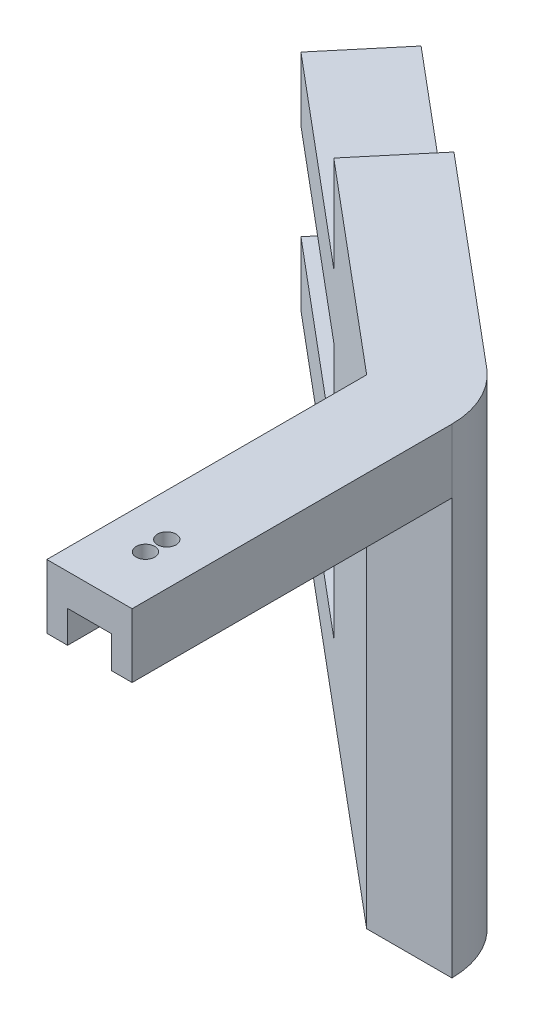
ISO-10303-21;
HEADER;
FILE_DESCRIPTION(('STEP AP214'),'2;1');
FILE_NAME('part.step','',(''),(''),'','','');
FILE_SCHEMA(('AUTOMOTIVE_DESIGN { 1 0 10303 214 1 1 1 1 }'));
ENDSEC;
DATA;
#1=APPLICATION_CONTEXT('core data for automotive mechanical design processes');
#2=APPLICATION_PROTOCOL_DEFINITION('international standard','automotive_design',2000,#1);
#3=PRODUCT_CONTEXT('',#1,'mechanical');
#4=PRODUCT('Part','Part','',(#3));
#5=PRODUCT_RELATED_PRODUCT_CATEGORY('part','',(#4));
#6=PRODUCT_DEFINITION_FORMATION('','',#4);
#7=PRODUCT_DEFINITION_CONTEXT('part definition',#1,'design');
#8=PRODUCT_DEFINITION('design','',#6,#7);
#9=PRODUCT_DEFINITION_SHAPE('','',#8);
#10=(LENGTH_UNIT() NAMED_UNIT(*) SI_UNIT(.MILLI.,.METRE.));
#11=(NAMED_UNIT(*) PLANE_ANGLE_UNIT() SI_UNIT($,.RADIAN.));
#12=(NAMED_UNIT(*) SI_UNIT($,.STERADIAN.) SOLID_ANGLE_UNIT());
#13=UNCERTAINTY_MEASURE_WITH_UNIT(LENGTH_MEASURE(1.E-05),#10,'distance_accuracy_value','');
#14=(GEOMETRIC_REPRESENTATION_CONTEXT(3) GLOBAL_UNCERTAINTY_ASSIGNED_CONTEXT((#13)) GLOBAL_UNIT_ASSIGNED_CONTEXT((#10,
#11,#12)) REPRESENTATION_CONTEXT('',''));
#15=CARTESIAN_POINT('',(0.,0.,0.));
#16=DIRECTION('',(0.,0.,1.));
#17=DIRECTION('',(1.,0.,0.));
#18=AXIS2_PLACEMENT_3D('',#15,#16,#17);
#19=CARTESIAN_POINT('',(0.,0.,0.));
#20=DIRECTION('',(0.,1.,0.));
#21=DIRECTION('',(0.,0.,1.));
#22=AXIS2_PLACEMENT_3D('',#19,#20,#21);
#23=PLANE('',#22);
#24=CARTESIAN_POINT('',(0.,0.,15.5));
#25=DIRECTION('',(0.,1.,0.));
#26=DIRECTION('',(0.,0.,1.));
#27=AXIS2_PLACEMENT_3D('',#24,#25,#26);
#28=CIRCLE('',#27,1.75);
#29=CARTESIAN_POINT('',(0.,0.,17.25));
#30=VERTEX_POINT('',#29);
#31=EDGE_CURVE('E443',#30,#30,#28,.T.);
#32=ORIENTED_EDGE('',*,*,#31,.F.);
#33=EDGE_LOOP('',(#32));
#34=FACE_BOUND('',#33,.T.);
#35=CARTESIAN_POINT('',(0.,0.,19.5));
#36=DIRECTION('',(0.,1.,0.));
#37=DIRECTION('',(0.,0.,1.));
#38=AXIS2_PLACEMENT_3D('',#35,#36,#37);
#39=CIRCLE('',#38,1.75);
#40=CARTESIAN_POINT('',(0.,0.,21.25));
#41=VERTEX_POINT('',#40);
#42=EDGE_CURVE('E444',#41,#41,#39,.T.);
#43=ORIENTED_EDGE('',*,*,#42,.F.);
#44=EDGE_LOOP('',(#43));
#45=FACE_BOUND('',#44,.T.);
#46=DIRECTION('',(-0.76604444311897,0.,-0.642787609686549));
#47=VECTOR('',#46,1.);
#48=CARTESIAN_POINT('',(21.7513107608356,0.,-25.9222027428582));
#49=LINE('',#48,#47);
#50=CARTESIAN_POINT('',(2.28460175498478,0.,-42.2567110899035));
#51=VERTEX_POINT('',#50);
#52=CARTESIAN_POINT('',(-36.0176204009637,0.,-74.3960915742309));
#53=VERTEX_POINT('',#52);
#54=EDGE_CURVE('E297',#51,#53,#49,.T.);
#55=ORIENTED_EDGE('',*,*,#54,.T.);
#56=DIRECTION('',(-0.64278760968655,0.,0.76604444311897));
#57=VECTOR('',#56,1.);
#58=CARTESIAN_POINT('',(-36.0176204009637,0.,-74.3960915742309));
#59=LINE('',#58,#57);
#60=CARTESIAN_POINT('',(-46.3022221559485,0.,-62.1393804843274));
#61=VERTEX_POINT('',#60);
#62=EDGE_CURVE('E263',#53,#61,#59,.T.);
#63=ORIENTED_EDGE('',*,*,#62,.T.);
#64=DIRECTION('',(-0.76604444311897,0.,-0.642787609686549));
#65=VECTOR('',#64,1.);
#66=CARTESIAN_POINT('',(11.4667090058508,0.,-13.6654916529547));
#67=LINE('',#66,#65);
#68=CARTESIAN_POINT('',(-8.,0.,-30.));
#69=VERTEX_POINT('',#68);
#70=EDGE_CURVE('E255',#69,#61,#67,.T.);
#71=ORIENTED_EDGE('',*,*,#70,.F.);
#72=DIRECTION('',(0.,0.,1.));
#73=VECTOR('',#72,1.);
#74=CARTESIAN_POINT('',(-8.,0.,0.));
#75=LINE('',#74,#73);
#76=CARTESIAN_POINT('',(-8.,0.,30.));
#77=VERTEX_POINT('',#76);
#78=EDGE_CURVE('E235',#69,#77,#75,.T.);
#79=ORIENTED_EDGE('',*,*,#78,.T.);
#80=DIRECTION('',(1.,0.,0.));
#81=VECTOR('',#80,1.);
#82=CARTESIAN_POINT('',(0.,0.,30.));
#83=LINE('',#82,#81);
#84=CARTESIAN_POINT('',(8.,0.,30.));
#85=VERTEX_POINT('',#84);
#86=EDGE_CURVE('E240',#77,#85,#83,.T.);
#87=ORIENTED_EDGE('',*,*,#86,.T.);
#88=DIRECTION('',(0.,0.,1.));
#89=VECTOR('',#88,1.);
#90=CARTESIAN_POINT('',(8.,0.,0.));
#91=LINE('',#90,#89);
#92=CARTESIAN_POINT('',(8.,0.,-30.));
#93=VERTEX_POINT('',#92);
#94=EDGE_CURVE('E231',#93,#85,#91,.T.);
#95=ORIENTED_EDGE('',*,*,#94,.F.);
#96=CARTESIAN_POINT('',(-8.,0.,-30.));
#97=DIRECTION('',(0.,1.,0.));
#98=DIRECTION('',(0.,0.,1.));
#99=AXIS2_PLACEMENT_3D('',#96,#97,#98);
#100=CIRCLE('',#99,16.);
#101=EDGE_CURVE('E265',#93,#51,#100,.T.);
#102=ORIENTED_EDGE('',*,*,#101,.T.);
#103=EDGE_LOOP('',(#55,#63,#71,#79,#87,#95,#102));
#104=FACE_BOUND('',#103,.T.);
#105=ADVANCED_FACE('F41',(#34,#45,#104),#23,.T.);
#106=CARTESIAN_POINT('',(-96.0711533177478,-90.,-80.6132693157002));
#107=DIRECTION('',(0.76604444311897,0.,0.642787609686549));
#108=DIRECTION('',(0.642787609686549,0.,-0.76604444311897));
#109=AXIS2_PLACEMENT_3D('',#106,#107,#108);
#110=PLANE('',#109);
#111=DIRECTION('',(-0.64278760968655,0.,0.76604444311897));
#112=VECTOR('',#111,1.);
#113=CARTESIAN_POINT('',(-74.3198425569122,-60.,-106.535472058558));
#114=LINE('',#113,#112);
#115=CARTESIAN_POINT('',(-74.3198425569122,-60.,-106.535472058558));
#116=VERTEX_POINT('',#115);
#117=CARTESIAN_POINT('',(-84.604444311897,-60.,-94.2787609686549));
#118=VERTEX_POINT('',#117);
#119=EDGE_CURVE('E366',#116,#118,#114,.T.);
#120=ORIENTED_EDGE('',*,*,#119,.T.);
#121=DIRECTION('',(0.,1.,0.));
#122=VECTOR('',#121,1.);
#123=CARTESIAN_POINT('',(-84.604444311897,-90.,-94.2787609686549));
#124=LINE('',#123,#122);
#125=CARTESIAN_POINT('',(-84.604444311897,-48.,-94.2787609686549));
#126=VERTEX_POINT('',#125);
#127=EDGE_CURVE('E282',#118,#126,#124,.T.);
#128=ORIENTED_EDGE('',*,*,#127,.T.);
#129=DIRECTION('',(-0.64278760968655,0.,0.76604444311897));
#130=VECTOR('',#129,1.);
#131=CARTESIAN_POINT('',(-74.3198425569122,-48.,-106.535472058558));
#132=LINE('',#131,#130);
#133=CARTESIAN_POINT('',(-74.3198425569122,-48.,-106.535472058558));
#134=VERTEX_POINT('',#133);
#135=EDGE_CURVE('E349',#134,#126,#132,.T.);
#136=ORIENTED_EDGE('',*,*,#135,.F.);
#137=DIRECTION('',(0.,1.,0.));
#138=VECTOR('',#137,1.);
#139=CARTESIAN_POINT('',(-74.3198425569122,-90.,-106.535472058558));
#140=LINE('',#139,#138);
#141=EDGE_CURVE('E296',#116,#134,#140,.T.);
#142=ORIENTED_EDGE('',*,*,#141,.F.);
#143=EDGE_LOOP('',(#120,#128,#136,#142));
#144=FACE_BOUND('',#143,.T.);
#145=ADVANCED_FACE('F457',(#144),#110,.F.);
#146=DIRECTION('',(-0.64278760968655,0.,0.76604444311897));
#147=VECTOR('',#146,1.);
#148=CARTESIAN_POINT('',(-74.3198425569122,-30.,-106.535472058558));
#149=LINE('',#148,#147);
#150=CARTESIAN_POINT('',(-74.3198425569122,-30.,-106.535472058558));
#151=VERTEX_POINT('',#150);
#152=CARTESIAN_POINT('',(-84.604444311897,-30.,-94.2787609686549));
#153=VERTEX_POINT('',#152);
#154=EDGE_CURVE('E362',#151,#153,#149,.T.);
#155=ORIENTED_EDGE('',*,*,#154,.T.);
#156=CARTESIAN_POINT('',(-84.604444311897,-18.,-94.2787609686549));
#157=VERTEX_POINT('',#156);
#158=EDGE_CURVE('E283',#153,#157,#124,.T.);
#159=ORIENTED_EDGE('',*,*,#158,.T.);
#160=DIRECTION('',(-0.64278760968655,0.,0.76604444311897));
#161=VECTOR('',#160,1.);
#162=CARTESIAN_POINT('',(-74.3198425569122,-18.,-106.535472058558));
#163=LINE('',#162,#161);
#164=CARTESIAN_POINT('',(-74.3198425569122,-18.,-106.535472058558));
#165=VERTEX_POINT('',#164);
#166=EDGE_CURVE('E324',#165,#157,#163,.T.);
#167=ORIENTED_EDGE('',*,*,#166,.F.);
#168=EDGE_CURVE('E292',#151,#165,#140,.T.);
#169=ORIENTED_EDGE('',*,*,#168,.F.);
#170=EDGE_LOOP('',(#155,#159,#167,#169));
#171=FACE_BOUND('',#170,.T.);
#172=ADVANCED_FACE('F497',(#171),#110,.F.);
#173=CARTESIAN_POINT('',(21.7513107608356,-90.,-25.9222027428582));
#174=DIRECTION('',(0.642787609686549,0.,-0.76604444311897));
#175=DIRECTION('',(-0.76604444311897,0.,-0.642787609686549));
#176=AXIS2_PLACEMENT_3D('',#173,#174,#175);
#177=PLANE('',#176);
#178=DIRECTION('',(0.,-1.,0.));
#179=VECTOR('',#178,1.);
#180=CARTESIAN_POINT('',(-36.0176204009637,-60.,-74.3960915742309));
#181=LINE('',#180,#179);
#182=CARTESIAN_POINT('',(-36.0176204009637,-60.,-74.3960915742309));
#183=VERTEX_POINT('',#182);
#184=CARTESIAN_POINT('',(-36.0176204009637,-78.,-74.3960915742309));
#185=VERTEX_POINT('',#184);
#186=EDGE_CURVE('E394',#183,#185,#181,.T.);
#187=ORIENTED_EDGE('',*,*,#186,.F.);
#188=DIRECTION('',(-0.76604444311897,0.,-0.642787609686549));
#189=VECTOR('',#188,1.);
#190=CARTESIAN_POINT('',(-36.0176204009637,-60.,-74.3960915742309));
#191=LINE('',#190,#189);
#192=EDGE_CURVE('E390',#183,#116,#191,.T.);
#193=ORIENTED_EDGE('',*,*,#192,.T.);
#194=ORIENTED_EDGE('',*,*,#141,.T.);
#195=DIRECTION('',(-0.76604444311897,0.,-0.642787609686549));
#196=VECTOR('',#195,1.);
#197=CARTESIAN_POINT('',(-36.0176204009637,-48.,-74.3960915742309));
#198=LINE('',#197,#196);
#199=CARTESIAN_POINT('',(-36.0176204009637,-48.,-74.3960915742309));
#200=VERTEX_POINT('',#199);
#201=EDGE_CURVE('E372',#200,#134,#198,.T.);
#202=ORIENTED_EDGE('',*,*,#201,.F.);
#203=DIRECTION('',(0.,-1.,0.));
#204=VECTOR('',#203,1.);
#205=CARTESIAN_POINT('',(-36.0176204009637,-30.,-74.3960915742309));
#206=LINE('',#205,#204);
#207=CARTESIAN_POINT('',(-36.0176204009637,-30.,-74.3960915742309));
#208=VERTEX_POINT('',#207);
#209=EDGE_CURVE('E357',#208,#200,#206,.T.);
#210=ORIENTED_EDGE('',*,*,#209,.F.);
#211=DIRECTION('',(-0.76604444311897,0.,-0.642787609686549));
#212=VECTOR('',#211,1.);
#213=CARTESIAN_POINT('',(-36.0176204009637,-30.,-74.3960915742309));
#214=LINE('',#213,#212);
#215=EDGE_CURVE('E361',#208,#151,#214,.T.);
#216=ORIENTED_EDGE('',*,*,#215,.T.);
#217=ORIENTED_EDGE('',*,*,#168,.T.);
#218=DIRECTION('',(-0.76604444311897,0.,-0.642787609686549));
#219=VECTOR('',#218,1.);
#220=CARTESIAN_POINT('',(-36.0176204009637,-18.,-74.3960915742309));
#221=LINE('',#220,#219);
#222=CARTESIAN_POINT('',(-36.0176204009637,-18.,-74.3960915742309));
#223=VERTEX_POINT('',#222);
#224=EDGE_CURVE('E334',#223,#165,#221,.T.);
#225=ORIENTED_EDGE('',*,*,#224,.F.);
#226=DIRECTION('',(0.,-1.,0.));
#227=VECTOR('',#226,1.);
#228=CARTESIAN_POINT('',(-36.0176204009637,0.,-74.3960915742309));
#229=LINE('',#228,#227);
#230=EDGE_CURVE('E328',#53,#223,#229,.T.);
#231=ORIENTED_EDGE('',*,*,#230,.F.);
#232=ORIENTED_EDGE('',*,*,#54,.F.);
#233=DIRECTION('',(0.,1.,0.));
#234=VECTOR('',#233,1.);
#235=CARTESIAN_POINT('',(2.28460175498478,-90.,-42.2567110899035));
#236=LINE('',#235,#234);
#237=CARTESIAN_POINT('',(2.28460175498478,-90.,-42.2567110899035));
#238=VERTEX_POINT('',#237);
#239=EDGE_CURVE('E289',#238,#51,#236,.T.);
#240=ORIENTED_EDGE('',*,*,#239,.F.);
#241=DIRECTION('',(-0.76604444311897,0.,-0.642787609686549));
#242=VECTOR('',#241,1.);
#243=CARTESIAN_POINT('',(21.7513107608356,-90.,-25.9222027428582));
#244=LINE('',#243,#242);
#245=CARTESIAN_POINT('',(-74.3198425569122,-90.,-106.535472058558));
#246=VERTEX_POINT('',#245);
#247=EDGE_CURVE('E304',#238,#246,#244,.T.);
#248=ORIENTED_EDGE('',*,*,#247,.T.);
#249=CARTESIAN_POINT('',(-74.3198425569122,-78.,-106.535472058558));
#250=VERTEX_POINT('',#249);
#251=EDGE_CURVE('E236',#246,#250,#140,.T.);
#252=ORIENTED_EDGE('',*,*,#251,.T.);
#253=DIRECTION('',(-0.76604444311897,0.,-0.642787609686549));
#254=VECTOR('',#253,1.);
#255=CARTESIAN_POINT('',(-36.0176204009637,-78.,-74.3960915742309));
#256=LINE('',#255,#254);
#257=EDGE_CURVE('E387',#185,#250,#256,.T.);
#258=ORIENTED_EDGE('',*,*,#257,.F.);
#259=EDGE_LOOP('',(#187,#193,#194,#202,#210,#216,#217,#225,#231,#232,#240,#248,#252,#258));
#260=FACE_BOUND('',#259,.T.);
#261=ADVANCED_FACE('F485',(#260),#177,.T.);
#262=CARTESIAN_POINT('',(11.4667090058508,-90.,-13.6654916529547));
#263=DIRECTION('',(0.642787609686549,0.,-0.76604444311897));
#264=DIRECTION('',(-0.76604444311897,0.,-0.642787609686549));
#265=AXIS2_PLACEMENT_3D('',#262,#263,#264);
#266=PLANE('',#265);
#267=DIRECTION('',(-0.76604444311897,0.,-0.642787609686549));
#268=VECTOR('',#267,1.);
#269=CARTESIAN_POINT('',(-46.3022221559485,-60.,-62.1393804843274));
#270=LINE('',#269,#268);
#271=CARTESIAN_POINT('',(-46.3022221559485,-60.,-62.1393804843274));
#272=VERTEX_POINT('',#271);
#273=EDGE_CURVE('E266',#272,#118,#270,.T.);
#274=ORIENTED_EDGE('',*,*,#273,.F.);
#275=DIRECTION('',(0.,-1.,0.));
#276=VECTOR('',#275,1.);
#277=CARTESIAN_POINT('',(-46.3022221559485,-60.,-62.1393804843274));
#278=LINE('',#277,#276);
#279=CARTESIAN_POINT('',(-46.3022221559485,-78.,-62.1393804843274));
#280=VERTEX_POINT('',#279);
#281=EDGE_CURVE('E406',#272,#280,#278,.T.);
#282=ORIENTED_EDGE('',*,*,#281,.T.);
#283=DIRECTION('',(-0.76604444311897,0.,-0.642787609686549));
#284=VECTOR('',#283,1.);
#285=CARTESIAN_POINT('',(-46.3022221559485,-78.,-62.1393804843274));
#286=LINE('',#285,#284);
#287=CARTESIAN_POINT('',(-84.604444311897,-78.,-94.2787609686549));
#288=VERTEX_POINT('',#287);
#289=EDGE_CURVE('E383',#280,#288,#286,.T.);
#290=ORIENTED_EDGE('',*,*,#289,.T.);
#291=CARTESIAN_POINT('',(-84.604444311897,-90.,-94.2787609686549));
#292=VERTEX_POINT('',#291);
#293=EDGE_CURVE('E278',#292,#288,#124,.T.);
#294=ORIENTED_EDGE('',*,*,#293,.F.);
#295=DIRECTION('',(-0.76604444311897,0.,-0.642787609686549));
#296=VECTOR('',#295,1.);
#297=CARTESIAN_POINT('',(11.4667090058508,-90.,-13.6654916529547));
#298=LINE('',#297,#296);
#299=CARTESIAN_POINT('',(-8.,-90.,-30.));
#300=VERTEX_POINT('',#299);
#301=EDGE_CURVE('E316',#300,#292,#298,.T.);
#302=ORIENTED_EDGE('',*,*,#301,.F.);
#303=DIRECTION('',(0.,1.,0.));
#304=VECTOR('',#303,1.);
#305=CARTESIAN_POINT('',(-8.,-90.,-30.));
#306=LINE('',#305,#304);
#307=CARTESIAN_POINT('',(-8.,-12.,-30.));
#308=VERTEX_POINT('',#307);
#309=EDGE_CURVE('E257',#300,#308,#306,.T.);
#310=ORIENTED_EDGE('',*,*,#309,.T.);
#311=DIRECTION('',(0.,1.,0.));
#312=VECTOR('',#311,1.);
#313=CARTESIAN_POINT('',(-8.,-12.,-30.));
#314=LINE('',#313,#312);
#315=EDGE_CURVE('E226',#308,#69,#314,.T.);
#316=ORIENTED_EDGE('',*,*,#315,.T.);
#317=ORIENTED_EDGE('',*,*,#70,.T.);
#318=DIRECTION('',(0.,-1.,0.));
#319=VECTOR('',#318,1.);
#320=CARTESIAN_POINT('',(-46.3022221559485,0.,-62.1393804843274));
#321=LINE('',#320,#319);
#322=CARTESIAN_POINT('',(-46.3022221559485,-18.,-62.1393804843274));
#323=VERTEX_POINT('',#322);
#324=EDGE_CURVE('E321',#61,#323,#321,.T.);
#325=ORIENTED_EDGE('',*,*,#324,.T.);
#326=DIRECTION('',(-0.76604444311897,0.,-0.642787609686549));
#327=VECTOR('',#326,1.);
#328=CARTESIAN_POINT('',(-46.3022221559485,-18.,-62.1393804843274));
#329=LINE('',#328,#327);
#330=EDGE_CURVE('E340',#323,#157,#329,.T.);
#331=ORIENTED_EDGE('',*,*,#330,.T.);
#332=ORIENTED_EDGE('',*,*,#158,.F.);
#333=DIRECTION('',(-0.76604444311897,0.,-0.642787609686549));
#334=VECTOR('',#333,1.);
#335=CARTESIAN_POINT('',(-46.3022221559485,-30.,-62.1393804843274));
#336=LINE('',#335,#334);
#337=CARTESIAN_POINT('',(-46.3022221559485,-30.,-62.1393804843274));
#338=VERTEX_POINT('',#337);
#339=EDGE_CURVE('E337',#338,#153,#336,.T.);
#340=ORIENTED_EDGE('',*,*,#339,.F.);
#341=DIRECTION('',(0.,-1.,0.));
#342=VECTOR('',#341,1.);
#343=CARTESIAN_POINT('',(-46.3022221559485,-30.,-62.1393804843274));
#344=LINE('',#343,#342);
#345=CARTESIAN_POINT('',(-46.3022221559485,-48.,-62.1393804843274));
#346=VERTEX_POINT('',#345);
#347=EDGE_CURVE('E350',#338,#346,#344,.T.);
#348=ORIENTED_EDGE('',*,*,#347,.T.);
#349=DIRECTION('',(-0.76604444311897,0.,-0.642787609686549));
#350=VECTOR('',#349,1.);
#351=CARTESIAN_POINT('',(-46.3022221559485,-48.,-62.1393804843274));
#352=LINE('',#351,#350);
#353=EDGE_CURVE('E375',#346,#126,#352,.T.);
#354=ORIENTED_EDGE('',*,*,#353,.T.);
#355=ORIENTED_EDGE('',*,*,#127,.F.);
#356=EDGE_LOOP('',(#274,#282,#290,#294,#302,#310,#316,#317,#325,#331,#332,#340,#348,#354,#355));
#357=FACE_BOUND('',#356,.T.);
#358=ADVANCED_FACE('F253',(#357),#266,.F.);
#359=CARTESIAN_POINT('',(8.,-12.,0.));
#360=DIRECTION('',(-1.,0.,0.));
#361=DIRECTION('',(0.,0.,1.));
#362=AXIS2_PLACEMENT_3D('',#359,#360,#361);
#363=PLANE('',#362);
#364=ORIENTED_EDGE('',*,*,#94,.T.);
#365=DIRECTION('',(0.,1.,0.));
#366=VECTOR('',#365,1.);
#367=CARTESIAN_POINT('',(8.,-12.,30.));
#368=LINE('',#367,#366);
#369=CARTESIAN_POINT('',(8.,-12.,30.));
#370=VERTEX_POINT('',#369);
#371=EDGE_CURVE('E11',#370,#85,#368,.T.);
#372=ORIENTED_EDGE('',*,*,#371,.F.);
#373=DIRECTION('',(0.,0.,1.));
#374=VECTOR('',#373,1.);
#375=CARTESIAN_POINT('',(8.,-12.,0.));
#376=LINE('',#375,#374);
#377=CARTESIAN_POINT('',(8.,-12.,-30.));
#378=VERTEX_POINT('',#377);
#379=EDGE_CURVE('E243',#378,#370,#376,.T.);
#380=ORIENTED_EDGE('',*,*,#379,.F.);
#381=DIRECTION('',(0.,1.,0.));
#382=VECTOR('',#381,1.);
#383=CARTESIAN_POINT('',(8.,-12.,-30.));
#384=LINE('',#383,#382);
#385=EDGE_CURVE('E45',#378,#93,#384,.T.);
#386=ORIENTED_EDGE('',*,*,#385,.T.);
#387=EDGE_LOOP('',(#364,#372,#380,#386));
#388=FACE_BOUND('',#387,.T.);
#389=ADVANCED_FACE('F43',(#388),#363,.F.);
#390=CARTESIAN_POINT('',(0.,-12.,30.));
#391=DIRECTION('',(0.,0.,1.));
#392=DIRECTION('',(1.,0.,0.));
#393=AXIS2_PLACEMENT_3D('',#390,#391,#392);
#394=PLANE('',#393);
#395=DIRECTION('',(0.,1.,0.));
#396=VECTOR('',#395,1.);
#397=CARTESIAN_POINT('',(-4.1,-12.,30.));
#398=LINE('',#397,#396);
#399=CARTESIAN_POINT('',(-4.1,-12.,30.));
#400=VERTEX_POINT('',#399);
#401=CARTESIAN_POINT('',(-4.1,-6.,30.));
#402=VERTEX_POINT('',#401);
#403=EDGE_CURVE('E193',#400,#402,#398,.T.);
#404=ORIENTED_EDGE('',*,*,#403,.T.);
#405=DIRECTION('',(1.,0.,0.));
#406=VECTOR('',#405,1.);
#407=CARTESIAN_POINT('',(0.,-6.,30.));
#408=LINE('',#407,#406);
#409=CARTESIAN_POINT('',(4.1,-6.,30.));
#410=VERTEX_POINT('',#409);
#411=EDGE_CURVE('E426',#402,#410,#408,.T.);
#412=ORIENTED_EDGE('',*,*,#411,.T.);
#413=DIRECTION('',(0.,1.,0.));
#414=VECTOR('',#413,1.);
#415=CARTESIAN_POINT('',(4.1,-12.,30.));
#416=LINE('',#415,#414);
#417=CARTESIAN_POINT('',(4.1,-12.,30.));
#418=VERTEX_POINT('',#417);
#419=EDGE_CURVE('E204',#418,#410,#416,.T.);
#420=ORIENTED_EDGE('',*,*,#419,.F.);
#421=DIRECTION('',(1.,0.,0.));
#422=VECTOR('',#421,1.);
#423=CARTESIAN_POINT('',(0.,-12.,30.));
#424=LINE('',#423,#422);
#425=EDGE_CURVE('E221',#418,#370,#424,.T.);
#426=ORIENTED_EDGE('',*,*,#425,.T.);
#427=ORIENTED_EDGE('',*,*,#371,.T.);
#428=ORIENTED_EDGE('',*,*,#86,.F.);
#429=DIRECTION('',(0.,1.,0.));
#430=VECTOR('',#429,1.);
#431=CARTESIAN_POINT('',(-8.,-12.,30.));
#432=LINE('',#431,#430);
#433=CARTESIAN_POINT('',(-8.,-12.,30.));
#434=VERTEX_POINT('',#433);
#435=EDGE_CURVE('E51',#434,#77,#432,.T.);
#436=ORIENTED_EDGE('',*,*,#435,.F.);
#437=EDGE_CURVE('E211',#434,#400,#424,.T.);
#438=ORIENTED_EDGE('',*,*,#437,.T.);
#439=EDGE_LOOP('',(#404,#412,#420,#426,#427,#428,#436,#438));
#440=FACE_BOUND('',#439,.T.);
#441=ADVANCED_FACE('F217',(#440),#394,.T.);
#442=CARTESIAN_POINT('',(-8.,-12.,0.));
#443=DIRECTION('',(-1.,0.,0.));
#444=DIRECTION('',(0.,0.,1.));
#445=AXIS2_PLACEMENT_3D('',#442,#443,#444);
#446=PLANE('',#445);
#447=ORIENTED_EDGE('',*,*,#78,.F.);
#448=ORIENTED_EDGE('',*,*,#315,.F.);
#449=DIRECTION('',(0.,0.,1.));
#450=VECTOR('',#449,1.);
#451=CARTESIAN_POINT('',(-8.,-12.,0.));
#452=LINE('',#451,#450);
#453=EDGE_CURVE('E227',#308,#434,#452,.T.);
#454=ORIENTED_EDGE('',*,*,#453,.T.);
#455=ORIENTED_EDGE('',*,*,#435,.T.);
#456=EDGE_LOOP('',(#447,#448,#454,#455));
#457=FACE_BOUND('',#456,.T.);
#458=ADVANCED_FACE('F268',(#457),#446,.T.);
#459=CARTESIAN_POINT('',(0.,-12.,0.));
#460=DIRECTION('',(0.,1.,0.));
#461=DIRECTION('',(0.,0.,1.));
#462=AXIS2_PLACEMENT_3D('',#459,#460,#461);
#463=PLANE('',#462);
#464=DIRECTION('',(1.,0.,0.));
#465=VECTOR('',#464,1.);
#466=CARTESIAN_POINT('',(0.,-12.,10.));
#467=LINE('',#466,#465);
#468=CARTESIAN_POINT('',(-4.1,-12.,10.));
#469=VERTEX_POINT('',#468);
#470=CARTESIAN_POINT('',(4.1,-12.,10.));
#471=VERTEX_POINT('',#470);
#472=EDGE_CURVE('E205',#469,#471,#467,.T.);
#473=ORIENTED_EDGE('',*,*,#472,.F.);
#474=DIRECTION('',(0.,0.,1.));
#475=VECTOR('',#474,1.);
#476=CARTESIAN_POINT('',(-4.1,-12.,0.));
#477=LINE('',#476,#475);
#478=EDGE_CURVE('E196',#469,#400,#477,.T.);
#479=ORIENTED_EDGE('',*,*,#478,.T.);
#480=ORIENTED_EDGE('',*,*,#437,.F.);
#481=ORIENTED_EDGE('',*,*,#453,.F.);
#482=DIRECTION('',(1.,0.,0.));
#483=VECTOR('',#482,1.);
#484=CARTESIAN_POINT('',(0.,-12.,-30.));
#485=LINE('',#484,#483);
#486=EDGE_CURVE('E271',#308,#378,#485,.T.);
#487=ORIENTED_EDGE('',*,*,#486,.T.);
#488=ORIENTED_EDGE('',*,*,#379,.T.);
#489=ORIENTED_EDGE('',*,*,#425,.F.);
#490=DIRECTION('',(0.,0.,1.));
#491=VECTOR('',#490,1.);
#492=CARTESIAN_POINT('',(4.1,-12.,0.));
#493=LINE('',#492,#491);
#494=EDGE_CURVE('E214',#471,#418,#493,.T.);
#495=ORIENTED_EDGE('',*,*,#494,.F.);
#496=EDGE_LOOP('',(#473,#479,#480,#481,#487,#488,#489,#495));
#497=FACE_BOUND('',#496,.T.);
#498=ADVANCED_FACE('F209',(#497),#463,.F.);
#499=CARTESIAN_POINT('',(0.,-90.,-30.));
#500=DIRECTION('',(0.,0.,1.));
#501=DIRECTION('',(1.,0.,0.));
#502=AXIS2_PLACEMENT_3D('',#499,#500,#501);
#503=PLANE('',#502);
#504=ORIENTED_EDGE('',*,*,#486,.F.);
#505=ORIENTED_EDGE('',*,*,#309,.F.);
#506=DIRECTION('',(1.,0.,0.));
#507=VECTOR('',#506,1.);
#508=CARTESIAN_POINT('',(0.,-90.,-30.));
#509=LINE('',#508,#507);
#510=CARTESIAN_POINT('',(8.,-90.,-30.));
#511=VERTEX_POINT('',#510);
#512=EDGE_CURVE('E312',#300,#511,#509,.T.);
#513=ORIENTED_EDGE('',*,*,#512,.T.);
#514=DIRECTION('',(0.,1.,0.));
#515=VECTOR('',#514,1.);
#516=CARTESIAN_POINT('',(8.,-90.,-30.));
#517=LINE('',#516,#515);
#518=EDGE_CURVE('E286',#511,#378,#517,.T.);
#519=ORIENTED_EDGE('',*,*,#518,.T.);
#520=EDGE_LOOP('',(#504,#505,#513,#519));
#521=FACE_BOUND('',#520,.T.);
#522=ADVANCED_FACE('F547',(#521),#503,.T.);
#523=ORIENTED_EDGE('',*,*,#293,.T.);
#524=DIRECTION('',(-0.64278760968655,0.,0.76604444311897));
#525=VECTOR('',#524,1.);
#526=CARTESIAN_POINT('',(-74.3198425569122,-78.,-106.535472058558));
#527=LINE('',#526,#525);
#528=EDGE_CURVE('E395',#250,#288,#527,.T.);
#529=ORIENTED_EDGE('',*,*,#528,.F.);
#530=ORIENTED_EDGE('',*,*,#251,.F.);
#531=DIRECTION('',(0.642787609686549,0.,-0.76604444311897));
#532=VECTOR('',#531,1.);
#533=CARTESIAN_POINT('',(-96.0711533177478,-90.,-80.6132693157002));
#534=LINE('',#533,#532);
#535=EDGE_CURVE('E300',#292,#246,#534,.T.);
#536=ORIENTED_EDGE('',*,*,#535,.F.);
#537=EDGE_LOOP('',(#523,#529,#530,#536));
#538=FACE_BOUND('',#537,.T.);
#539=ADVANCED_FACE('F546',(#538),#110,.F.);
#540=CARTESIAN_POINT('',(-8.,-90.,-30.));
#541=DIRECTION('',(0.,1.,0.));
#542=DIRECTION('',(0.,0.,1.));
#543=AXIS2_PLACEMENT_3D('',#540,#541,#542);
#544=CYLINDRICAL_SURFACE('',#543,16.);
#545=ORIENTED_EDGE('',*,*,#101,.F.);
#546=ORIENTED_EDGE('',*,*,#385,.F.);
#547=ORIENTED_EDGE('',*,*,#518,.F.);
#548=CARTESIAN_POINT('',(-8.,-90.,-30.));
#549=DIRECTION('',(0.,1.,0.));
#550=DIRECTION('',(0.,0.,1.));
#551=AXIS2_PLACEMENT_3D('',#548,#549,#550);
#552=CIRCLE('',#551,16.);
#553=EDGE_CURVE('E308',#511,#238,#552,.T.);
#554=ORIENTED_EDGE('',*,*,#553,.T.);
#555=ORIENTED_EDGE('',*,*,#239,.T.);
#556=EDGE_LOOP('',(#545,#546,#547,#554,#555));
#557=FACE_BOUND('',#556,.T.);
#558=ADVANCED_FACE('F540',(#557),#544,.T.);
#559=CARTESIAN_POINT('',(0.,-90.,0.));
#560=DIRECTION('',(0.,1.,0.));
#561=DIRECTION('',(0.,0.,1.));
#562=AXIS2_PLACEMENT_3D('',#559,#560,#561);
#563=PLANE('',#562);
#564=ORIENTED_EDGE('',*,*,#535,.T.);
#565=ORIENTED_EDGE('',*,*,#247,.F.);
#566=ORIENTED_EDGE('',*,*,#553,.F.);
#567=ORIENTED_EDGE('',*,*,#512,.F.);
#568=ORIENTED_EDGE('',*,*,#301,.T.);
#569=EDGE_LOOP('',(#564,#565,#566,#567,#568));
#570=FACE_BOUND('',#569,.T.);
#571=ADVANCED_FACE('F535',(#570),#563,.F.);
#572=CARTESIAN_POINT('',(-36.0176204009637,-18.,-74.3960915742309));
#573=DIRECTION('',(0.,-1.,0.));
#574=DIRECTION('',(0.,0.,-1.));
#575=AXIS2_PLACEMENT_3D('',#572,#573,#574);
#576=PLANE('',#575);
#577=ORIENTED_EDGE('',*,*,#166,.T.);
#578=ORIENTED_EDGE('',*,*,#330,.F.);
#579=DIRECTION('',(-0.64278760968655,0.,0.76604444311897));
#580=VECTOR('',#579,1.);
#581=CARTESIAN_POINT('',(-36.0176204009637,-18.,-74.3960915742309));
#582=LINE('',#581,#580);
#583=EDGE_CURVE('E325',#223,#323,#582,.T.);
#584=ORIENTED_EDGE('',*,*,#583,.F.);
#585=ORIENTED_EDGE('',*,*,#224,.T.);
#586=EDGE_LOOP('',(#577,#578,#584,#585));
#587=FACE_BOUND('',#586,.T.);
#588=ADVANCED_FACE('F532',(#587),#576,.F.);
#589=CARTESIAN_POINT('',(-57.7689311617992,0.,-48.4738888313728));
#590=DIRECTION('',(-0.766044443118969,0.,-0.64278760968655));
#591=DIRECTION('',(-0.64278760968655,0.,0.76604444311897));
#592=AXIS2_PLACEMENT_3D('',#589,#590,#591);
#593=PLANE('',#592);
#594=ORIENTED_EDGE('',*,*,#324,.F.);
#595=ORIENTED_EDGE('',*,*,#62,.F.);
#596=ORIENTED_EDGE('',*,*,#230,.T.);
#597=ORIENTED_EDGE('',*,*,#583,.T.);
#598=EDGE_LOOP('',(#594,#595,#596,#597));
#599=FACE_BOUND('',#598,.T.);
#600=ADVANCED_FACE('F489',(#599),#593,.T.);
#601=CARTESIAN_POINT('',(-36.0176204009637,-30.,-74.3960915742309));
#602=DIRECTION('',(0.,-1.,0.));
#603=DIRECTION('',(0.,0.,-1.));
#604=AXIS2_PLACEMENT_3D('',#601,#602,#603);
#605=PLANE('',#604);
#606=ORIENTED_EDGE('',*,*,#154,.F.);
#607=ORIENTED_EDGE('',*,*,#215,.F.);
#608=DIRECTION('',(-0.64278760968655,0.,0.76604444311897));
#609=VECTOR('',#608,1.);
#610=CARTESIAN_POINT('',(-36.0176204009637,-30.,-74.3960915742309));
#611=LINE('',#610,#609);
#612=EDGE_CURVE('E345',#208,#338,#611,.T.);
#613=ORIENTED_EDGE('',*,*,#612,.T.);
#614=ORIENTED_EDGE('',*,*,#339,.T.);
#615=EDGE_LOOP('',(#606,#607,#613,#614));
#616=FACE_BOUND('',#615,.T.);
#617=ADVANCED_FACE('F516',(#616),#605,.T.);
#618=CARTESIAN_POINT('',(-36.0176204009637,-48.,-74.3960915742309));
#619=DIRECTION('',(0.,-1.,0.));
#620=DIRECTION('',(0.,0.,-1.));
#621=AXIS2_PLACEMENT_3D('',#618,#619,#620);
#622=PLANE('',#621);
#623=ORIENTED_EDGE('',*,*,#135,.T.);
#624=ORIENTED_EDGE('',*,*,#353,.F.);
#625=DIRECTION('',(-0.64278760968655,0.,0.76604444311897));
#626=VECTOR('',#625,1.);
#627=CARTESIAN_POINT('',(-36.0176204009637,-48.,-74.3960915742309));
#628=LINE('',#627,#626);
#629=EDGE_CURVE('E354',#200,#346,#628,.T.);
#630=ORIENTED_EDGE('',*,*,#629,.F.);
#631=ORIENTED_EDGE('',*,*,#201,.T.);
#632=EDGE_LOOP('',(#623,#624,#630,#631));
#633=FACE_BOUND('',#632,.T.);
#634=ADVANCED_FACE('F509',(#633),#622,.F.);
#635=CARTESIAN_POINT('',(-57.7689311617992,0.,-48.4738888313728));
#636=DIRECTION('',(0.766044443118969,0.,0.64278760968655));
#637=DIRECTION('',(0.64278760968655,0.,-0.76604444311897));
#638=AXIS2_PLACEMENT_3D('',#635,#636,#637);
#639=PLANE('',#638);
#640=ORIENTED_EDGE('',*,*,#612,.F.);
#641=ORIENTED_EDGE('',*,*,#209,.T.);
#642=ORIENTED_EDGE('',*,*,#629,.T.);
#643=ORIENTED_EDGE('',*,*,#347,.F.);
#644=EDGE_LOOP('',(#640,#641,#642,#643));
#645=FACE_BOUND('',#644,.T.);
#646=ADVANCED_FACE('F518',(#645),#639,.F.);
#647=CARTESIAN_POINT('',(-36.0176204009637,-60.,-74.3960915742309));
#648=DIRECTION('',(0.,-1.,0.));
#649=DIRECTION('',(0.,0.,-1.));
#650=AXIS2_PLACEMENT_3D('',#647,#648,#649);
#651=PLANE('',#650);
#652=ORIENTED_EDGE('',*,*,#119,.F.);
#653=ORIENTED_EDGE('',*,*,#192,.F.);
#654=DIRECTION('',(-0.64278760968655,0.,0.76604444311897));
#655=VECTOR('',#654,1.);
#656=CARTESIAN_POINT('',(-36.0176204009637,-60.,-74.3960915742309));
#657=LINE('',#656,#655);
#658=EDGE_CURVE('E398',#183,#272,#657,.T.);
#659=ORIENTED_EDGE('',*,*,#658,.T.);
#660=ORIENTED_EDGE('',*,*,#273,.T.);
#661=EDGE_LOOP('',(#652,#653,#659,#660));
#662=FACE_BOUND('',#661,.T.);
#663=ADVANCED_FACE('F520',(#662),#651,.T.);
#664=CARTESIAN_POINT('',(-36.0176204009637,-78.,-74.3960915742309));
#665=DIRECTION('',(0.,-1.,0.));
#666=DIRECTION('',(0.,0.,-1.));
#667=AXIS2_PLACEMENT_3D('',#664,#665,#666);
#668=PLANE('',#667);
#669=ORIENTED_EDGE('',*,*,#528,.T.);
#670=ORIENTED_EDGE('',*,*,#289,.F.);
#671=DIRECTION('',(-0.64278760968655,0.,0.76604444311897));
#672=VECTOR('',#671,1.);
#673=CARTESIAN_POINT('',(-36.0176204009637,-78.,-74.3960915742309));
#674=LINE('',#673,#672);
#675=EDGE_CURVE('E67',#185,#280,#674,.T.);
#676=ORIENTED_EDGE('',*,*,#675,.F.);
#677=ORIENTED_EDGE('',*,*,#257,.T.);
#678=EDGE_LOOP('',(#669,#670,#676,#677));
#679=FACE_BOUND('',#678,.T.);
#680=ADVANCED_FACE('F526',(#679),#668,.F.);
#681=CARTESIAN_POINT('',(-57.7689311617992,0.,-48.4738888313728));
#682=DIRECTION('',(0.766044443118969,0.,0.64278760968655));
#683=DIRECTION('',(0.64278760968655,0.,-0.76604444311897));
#684=AXIS2_PLACEMENT_3D('',#681,#682,#683);
#685=PLANE('',#684);
#686=ORIENTED_EDGE('',*,*,#658,.F.);
#687=ORIENTED_EDGE('',*,*,#186,.T.);
#688=ORIENTED_EDGE('',*,*,#675,.T.);
#689=ORIENTED_EDGE('',*,*,#281,.F.);
#690=EDGE_LOOP('',(#686,#687,#688,#689));
#691=FACE_BOUND('',#690,.T.);
#692=ADVANCED_FACE('F625',(#691),#685,.F.);
#693=CARTESIAN_POINT('',(-4.1,-12.,0.));
#694=DIRECTION('',(-1.,0.,0.));
#695=DIRECTION('',(0.,0.,1.));
#696=AXIS2_PLACEMENT_3D('',#693,#694,#695);
#697=PLANE('',#696);
#698=DIRECTION('',(0.,0.,1.));
#699=VECTOR('',#698,1.);
#700=CARTESIAN_POINT('',(-4.1,-6.,0.));
#701=LINE('',#700,#699);
#702=CARTESIAN_POINT('',(-4.1,-6.,10.));
#703=VERTEX_POINT('',#702);
#704=EDGE_CURVE('E199',#703,#402,#701,.T.);
#705=ORIENTED_EDGE('',*,*,#704,.T.);
#706=ORIENTED_EDGE('',*,*,#403,.F.);
#707=ORIENTED_EDGE('',*,*,#478,.F.);
#708=DIRECTION('',(0.,1.,0.));
#709=VECTOR('',#708,1.);
#710=CARTESIAN_POINT('',(-4.1,-12.,10.));
#711=LINE('',#710,#709);
#712=EDGE_CURVE('E344',#469,#703,#711,.T.);
#713=ORIENTED_EDGE('',*,*,#712,.T.);
#714=EDGE_LOOP('',(#705,#706,#707,#713));
#715=FACE_BOUND('',#714,.T.);
#716=ADVANCED_FACE('F195',(#715),#697,.F.);
#717=CARTESIAN_POINT('',(0.,-12.,10.));
#718=DIRECTION('',(0.,0.,1.));
#719=DIRECTION('',(1.,0.,0.));
#720=AXIS2_PLACEMENT_3D('',#717,#718,#719);
#721=PLANE('',#720);
#722=DIRECTION('',(1.,0.,0.));
#723=VECTOR('',#722,1.);
#724=CARTESIAN_POINT('',(0.,-6.,10.));
#725=LINE('',#724,#723);
#726=CARTESIAN_POINT('',(4.1,-6.,10.));
#727=VERTEX_POINT('',#726);
#728=EDGE_CURVE('E215',#703,#727,#725,.T.);
#729=ORIENTED_EDGE('',*,*,#728,.F.);
#730=ORIENTED_EDGE('',*,*,#712,.F.);
#731=ORIENTED_EDGE('',*,*,#472,.T.);
#732=DIRECTION('',(0.,1.,0.));
#733=VECTOR('',#732,1.);
#734=CARTESIAN_POINT('',(4.1,-12.,10.));
#735=LINE('',#734,#733);
#736=EDGE_CURVE('E59',#471,#727,#735,.T.);
#737=ORIENTED_EDGE('',*,*,#736,.T.);
#738=EDGE_LOOP('',(#729,#730,#731,#737));
#739=FACE_BOUND('',#738,.T.);
#740=ADVANCED_FACE('F719',(#739),#721,.T.);
#741=CARTESIAN_POINT('',(4.1,-12.,0.));
#742=DIRECTION('',(-1.,0.,0.));
#743=DIRECTION('',(0.,0.,1.));
#744=AXIS2_PLACEMENT_3D('',#741,#742,#743);
#745=PLANE('',#744);
#746=DIRECTION('',(0.,0.,1.));
#747=VECTOR('',#746,1.);
#748=CARTESIAN_POINT('',(4.1,-6.,0.));
#749=LINE('',#748,#747);
#750=EDGE_CURVE('E422',#727,#410,#749,.T.);
#751=ORIENTED_EDGE('',*,*,#750,.F.);
#752=ORIENTED_EDGE('',*,*,#736,.F.);
#753=ORIENTED_EDGE('',*,*,#494,.T.);
#754=ORIENTED_EDGE('',*,*,#419,.T.);
#755=EDGE_LOOP('',(#751,#752,#753,#754));
#756=FACE_BOUND('',#755,.T.);
#757=ADVANCED_FACE('F470',(#756),#745,.T.);
#758=CARTESIAN_POINT('',(0.,-6.,0.));
#759=DIRECTION('',(0.,1.,0.));
#760=DIRECTION('',(0.,0.,1.));
#761=AXIS2_PLACEMENT_3D('',#758,#759,#760);
#762=PLANE('',#761);
#763=CARTESIAN_POINT('',(0.,-6.,15.5));
#764=DIRECTION('',(0.,1.,0.));
#765=DIRECTION('',(0.,0.,1.));
#766=AXIS2_PLACEMENT_3D('',#763,#764,#765);
#767=CIRCLE('',#766,1.75);
#768=CARTESIAN_POINT('',(0.,-6.,17.25));
#769=VERTEX_POINT('',#768);
#770=EDGE_CURVE('E439',#769,#769,#767,.T.);
#771=ORIENTED_EDGE('',*,*,#770,.T.);
#772=EDGE_LOOP('',(#771));
#773=FACE_BOUND('',#772,.T.);
#774=CARTESIAN_POINT('',(0.,-6.,19.5));
#775=DIRECTION('',(0.,1.,0.));
#776=DIRECTION('',(0.,0.,1.));
#777=AXIS2_PLACEMENT_3D('',#774,#775,#776);
#778=CIRCLE('',#777,1.75);
#779=CARTESIAN_POINT('',(0.,-6.,21.25));
#780=VERTEX_POINT('',#779);
#781=EDGE_CURVE('E431',#780,#780,#778,.T.);
#782=ORIENTED_EDGE('',*,*,#781,.T.);
#783=EDGE_LOOP('',(#782));
#784=FACE_BOUND('',#783,.T.);
#785=ORIENTED_EDGE('',*,*,#704,.F.);
#786=ORIENTED_EDGE('',*,*,#728,.T.);
#787=ORIENTED_EDGE('',*,*,#750,.T.);
#788=ORIENTED_EDGE('',*,*,#411,.F.);
#789=EDGE_LOOP('',(#785,#786,#787,#788));
#790=FACE_BOUND('',#789,.T.);
#791=ADVANCED_FACE('F464',(#773,#784,#790),#762,.F.);
#792=CARTESIAN_POINT('',(0.,-12.,19.5));
#793=DIRECTION('',(0.,1.,0.));
#794=DIRECTION('',(0.,0.,1.));
#795=AXIS2_PLACEMENT_3D('',#792,#793,#794);
#796=CYLINDRICAL_SURFACE('',#795,1.75);
#797=ORIENTED_EDGE('',*,*,#42,.T.);
#798=EDGE_LOOP('',(#797));
#799=FACE_BOUND('',#798,.T.);
#800=ORIENTED_EDGE('',*,*,#781,.F.);
#801=EDGE_LOOP('',(#800));
#802=FACE_BOUND('',#801,.T.);
#803=ADVANCED_FACE('F461',(#799,#802),#796,.F.);
#804=CARTESIAN_POINT('',(0.,-12.,15.5));
#805=DIRECTION('',(0.,1.,0.));
#806=DIRECTION('',(0.,0.,1.));
#807=AXIS2_PLACEMENT_3D('',#804,#805,#806);
#808=CYLINDRICAL_SURFACE('',#807,1.75);
#809=ORIENTED_EDGE('',*,*,#31,.T.);
#810=EDGE_LOOP('',(#809));
#811=FACE_BOUND('',#810,.T.);
#812=ORIENTED_EDGE('',*,*,#770,.F.);
#813=EDGE_LOOP('',(#812));
#814=FACE_BOUND('',#813,.T.);
#815=ADVANCED_FACE('F452',(#811,#814),#808,.F.);
#816=CLOSED_SHELL('',(#105,#145,#172,#261,#358,#389,#441,#458,#498,#522,#539,#558,#571,#588,
#600,#617,#634,#646,#663,#680,#692,#716,#740,#757,#791,#803,#815));
#817=MANIFOLD_SOLID_BREP('B2',#816);
#818=ADVANCED_BREP_SHAPE_REPRESENTATION('',(#18,#817),#14);
#819=SHAPE_DEFINITION_REPRESENTATION(#9,#818);
ENDSEC;
END-ISO-10303-21;
